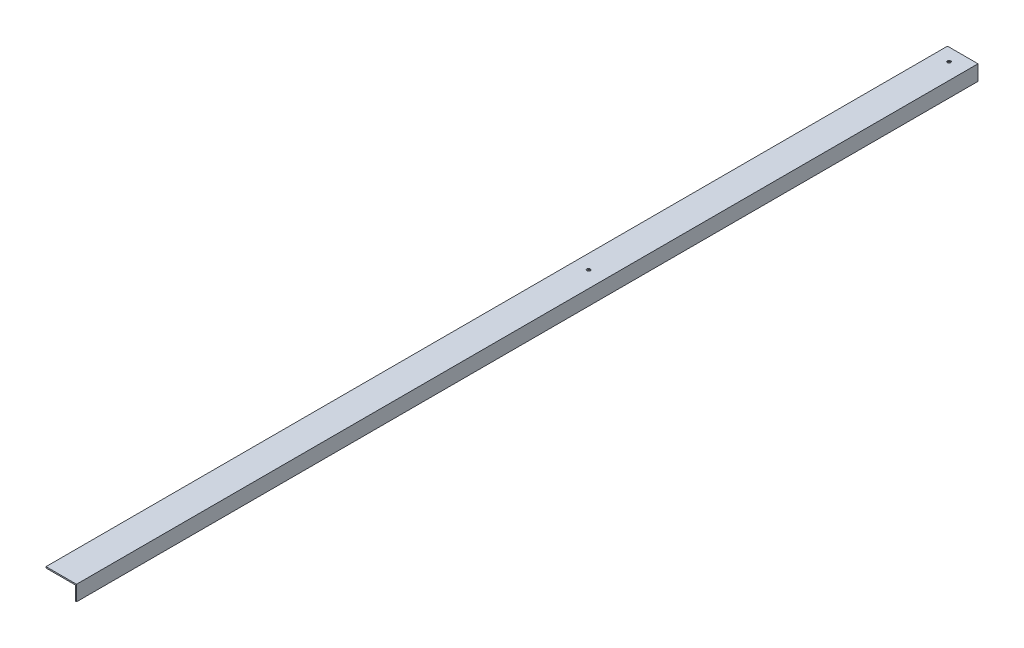
ISO-10303-21;
HEADER;
FILE_DESCRIPTION(('STEP AP214'),'2;1');
FILE_NAME('part.step','',(''),(''),'','','');
FILE_SCHEMA(('AUTOMOTIVE_DESIGN { 1 0 10303 214 1 1 1 1 }'));
ENDSEC;
DATA;
#1=APPLICATION_CONTEXT('core data for automotive mechanical design processes');
#2=APPLICATION_PROTOCOL_DEFINITION('international standard','automotive_design',2000,#1);
#3=PRODUCT_CONTEXT('',#1,'mechanical');
#4=PRODUCT('Part','Part','',(#3));
#5=PRODUCT_RELATED_PRODUCT_CATEGORY('part','',(#4));
#6=PRODUCT_DEFINITION_FORMATION('','',#4);
#7=PRODUCT_DEFINITION_CONTEXT('part definition',#1,'design');
#8=PRODUCT_DEFINITION('design','',#6,#7);
#9=PRODUCT_DEFINITION_SHAPE('','',#8);
#10=(LENGTH_UNIT() NAMED_UNIT(*) SI_UNIT(.MILLI.,.METRE.));
#11=(NAMED_UNIT(*) PLANE_ANGLE_UNIT() SI_UNIT($,.RADIAN.));
#12=(NAMED_UNIT(*) SI_UNIT($,.STERADIAN.) SOLID_ANGLE_UNIT());
#13=UNCERTAINTY_MEASURE_WITH_UNIT(LENGTH_MEASURE(1.E-05),#10,'distance_accuracy_value','');
#14=(GEOMETRIC_REPRESENTATION_CONTEXT(3) GLOBAL_UNCERTAINTY_ASSIGNED_CONTEXT((#13)) GLOBAL_UNIT_ASSIGNED_CONTEXT((#10,
#11,#12)) REPRESENTATION_CONTEXT('',''));
#15=CARTESIAN_POINT('',(0.,0.,0.));
#16=DIRECTION('',(0.,0.,1.));
#17=DIRECTION('',(1.,0.,0.));
#18=AXIS2_PLACEMENT_3D('',#15,#16,#17);
#19=CARTESIAN_POINT('',(-1.5748,0.,1125.4359));
#20=DIRECTION('',(1.,0.,0.));
#21=DIRECTION('',(0.,1.,0.));
#22=AXIS2_PLACEMENT_3D('',#19,#20,#21);
#23=PLANE('',#22);
#24=DIRECTION('',(0.,-1.,0.));
#25=VECTOR('',#24,1.);
#26=CARTESIAN_POINT('',(-1.5748,0.,0.));
#27=LINE('',#26,#25);
#28=CARTESIAN_POINT('',(-1.5748,-1.5748,0.));
#29=VERTEX_POINT('',#28);
#30=CARTESIAN_POINT('',(-1.5748,-19.05,0.));
#31=VERTEX_POINT('',#30);
#32=EDGE_CURVE('E113',#29,#31,#27,.T.);
#33=ORIENTED_EDGE('',*,*,#32,.T.);
#34=DIRECTION('',(0.,0.,-1.));
#35=VECTOR('',#34,1.);
#36=CARTESIAN_POINT('',(-1.5748,-19.05,1125.4359));
#37=LINE('',#36,#35);
#38=CARTESIAN_POINT('',(-1.5748,-19.05,1125.4359));
#39=VERTEX_POINT('',#38);
#40=EDGE_CURVE('E11',#39,#31,#37,.T.);
#41=ORIENTED_EDGE('',*,*,#40,.F.);
#42=DIRECTION('',(0.,-1.,0.));
#43=VECTOR('',#42,1.);
#44=CARTESIAN_POINT('',(-1.5748,0.,1125.4359));
#45=LINE('',#44,#43);
#46=CARTESIAN_POINT('',(-1.5748,-1.5748,1125.4359));
#47=VERTEX_POINT('',#46);
#48=EDGE_CURVE('E78',#47,#39,#45,.T.);
#49=ORIENTED_EDGE('',*,*,#48,.F.);
#50=DIRECTION('',(0.,0.,-1.));
#51=VECTOR('',#50,1.);
#52=CARTESIAN_POINT('',(-1.5748,-1.5748,1125.4359));
#53=LINE('',#52,#51);
#54=EDGE_CURVE('E109',#47,#29,#53,.T.);
#55=ORIENTED_EDGE('',*,*,#54,.T.);
#56=EDGE_LOOP('',(#33,#41,#49,#55));
#57=FACE_BOUND('',#56,.T.);
#58=ADVANCED_FACE('F32',(#57),#23,.F.);
#59=CARTESIAN_POINT('',(0.,-19.05,1125.4359));
#60=DIRECTION('',(0.,-1.,0.));
#61=DIRECTION('',(0.,0.,-1.));
#62=AXIS2_PLACEMENT_3D('',#59,#60,#61);
#63=PLANE('',#62);
#64=DIRECTION('',(-1.,0.,0.));
#65=VECTOR('',#64,1.);
#66=CARTESIAN_POINT('',(0.,-19.05,0.));
#67=LINE('',#66,#65);
#68=CARTESIAN_POINT('',(0.,-19.05,0.));
#69=VERTEX_POINT('',#68);
#70=EDGE_CURVE('E116',#69,#31,#67,.T.);
#71=ORIENTED_EDGE('',*,*,#70,.F.);
#72=DIRECTION('',(0.,0.,-1.));
#73=VECTOR('',#72,1.);
#74=CARTESIAN_POINT('',(0.,-19.05,1125.4359));
#75=LINE('',#74,#73);
#76=CARTESIAN_POINT('',(0.,-19.05,1125.4359));
#77=VERTEX_POINT('',#76);
#78=EDGE_CURVE('E40',#77,#69,#75,.T.);
#79=ORIENTED_EDGE('',*,*,#78,.F.);
#80=DIRECTION('',(-1.,0.,0.));
#81=VECTOR('',#80,1.);
#82=CARTESIAN_POINT('',(0.,-19.05,1125.4359));
#83=LINE('',#82,#81);
#84=EDGE_CURVE('E187',#77,#39,#83,.T.);
#85=ORIENTED_EDGE('',*,*,#84,.T.);
#86=ORIENTED_EDGE('',*,*,#40,.T.);
#87=EDGE_LOOP('',(#71,#79,#85,#86));
#88=FACE_BOUND('',#87,.T.);
#89=ADVANCED_FACE('F135',(#88),#63,.T.);
#90=CARTESIAN_POINT('',(0.,0.,1125.4359));
#91=DIRECTION('',(1.,0.,0.));
#92=DIRECTION('',(0.,1.,0.));
#93=AXIS2_PLACEMENT_3D('',#90,#91,#92);
#94=PLANE('',#93);
#95=DIRECTION('',(0.,-1.,0.));
#96=VECTOR('',#95,1.);
#97=CARTESIAN_POINT('',(0.,0.,0.));
#98=LINE('',#97,#96);
#99=CARTESIAN_POINT('',(0.,0.,0.));
#100=VERTEX_POINT('',#99);
#101=EDGE_CURVE('E120',#100,#69,#98,.T.);
#102=ORIENTED_EDGE('',*,*,#101,.F.);
#103=DIRECTION('',(0.,0.,-1.));
#104=VECTOR('',#103,1.);
#105=CARTESIAN_POINT('',(0.,0.,1125.4359));
#106=LINE('',#105,#104);
#107=CARTESIAN_POINT('',(0.,0.,1125.4359));
#108=VERTEX_POINT('',#107);
#109=EDGE_CURVE('E99',#108,#100,#106,.T.);
#110=ORIENTED_EDGE('',*,*,#109,.F.);
#111=DIRECTION('',(0.,-1.,0.));
#112=VECTOR('',#111,1.);
#113=CARTESIAN_POINT('',(0.,0.,1125.4359));
#114=LINE('',#113,#112);
#115=EDGE_CURVE('E105',#108,#77,#114,.T.);
#116=ORIENTED_EDGE('',*,*,#115,.T.);
#117=ORIENTED_EDGE('',*,*,#78,.T.);
#118=EDGE_LOOP('',(#102,#110,#116,#117));
#119=FACE_BOUND('',#118,.T.);
#120=ADVANCED_FACE('F132',(#119),#94,.T.);
#121=CARTESIAN_POINT('',(-38.1,0.,1125.4359));
#122=DIRECTION('',(0.,1.,0.));
#123=DIRECTION('',(0.,0.,1.));
#124=AXIS2_PLACEMENT_3D('',#121,#122,#123);
#125=PLANE('',#124);
#126=CARTESIAN_POINT('',(-20.32,0.,15.875));
#127=DIRECTION('',(0.,1.,0.));
#128=DIRECTION('',(0.,0.,1.));
#129=AXIS2_PLACEMENT_3D('',#126,#127,#128);
#130=CIRCLE('',#129,2.1082);
#131=CARTESIAN_POINT('',(-20.32,0.,17.9832));
#132=VERTEX_POINT('',#131);
#133=EDGE_CURVE('E169',#132,#132,#130,.T.);
#134=ORIENTED_EDGE('',*,*,#133,.F.);
#135=EDGE_LOOP('',(#134));
#136=FACE_BOUND('',#135,.T.);
#137=CARTESIAN_POINT('',(-20.32,0.,465.875));
#138=DIRECTION('',(0.,1.,0.));
#139=DIRECTION('',(0.,0.,1.));
#140=AXIS2_PLACEMENT_3D('',#137,#138,#139);
#141=CIRCLE('',#140,2.1082);
#142=CARTESIAN_POINT('',(-20.32,0.,467.9832));
#143=VERTEX_POINT('',#142);
#144=EDGE_CURVE('E172',#143,#143,#141,.T.);
#145=ORIENTED_EDGE('',*,*,#144,.F.);
#146=EDGE_LOOP('',(#145));
#147=FACE_BOUND('',#146,.T.);
#148=DIRECTION('',(1.,0.,0.));
#149=VECTOR('',#148,1.);
#150=CARTESIAN_POINT('',(-38.1,0.,0.));
#151=LINE('',#150,#149);
#152=CARTESIAN_POINT('',(-38.1,0.,0.));
#153=VERTEX_POINT('',#152);
#154=EDGE_CURVE('E94',#153,#100,#151,.T.);
#155=ORIENTED_EDGE('',*,*,#154,.F.);
#156=DIRECTION('',(0.,0.,-1.));
#157=VECTOR('',#156,1.);
#158=CARTESIAN_POINT('',(-38.1,0.,1125.4359));
#159=LINE('',#158,#157);
#160=CARTESIAN_POINT('',(-38.1,0.,1125.4359));
#161=VERTEX_POINT('',#160);
#162=EDGE_CURVE('E89',#161,#153,#159,.T.);
#163=ORIENTED_EDGE('',*,*,#162,.F.);
#164=DIRECTION('',(1.,0.,0.));
#165=VECTOR('',#164,1.);
#166=CARTESIAN_POINT('',(-38.1,0.,1125.4359));
#167=LINE('',#166,#165);
#168=EDGE_CURVE('E92',#161,#108,#167,.T.);
#169=ORIENTED_EDGE('',*,*,#168,.T.);
#170=ORIENTED_EDGE('',*,*,#109,.T.);
#171=EDGE_LOOP('',(#155,#163,#169,#170));
#172=FACE_BOUND('',#171,.T.);
#173=ADVANCED_FACE('F91',(#136,#147,#172),#125,.T.);
#174=CARTESIAN_POINT('',(-38.1,-1.5748,1125.4359));
#175=DIRECTION('',(-1.,0.,0.));
#176=DIRECTION('',(0.,0.,1.));
#177=AXIS2_PLACEMENT_3D('',#174,#175,#176);
#178=PLANE('',#177);
#179=DIRECTION('',(0.,1.,0.));
#180=VECTOR('',#179,1.);
#181=CARTESIAN_POINT('',(-38.1,-1.5748,0.));
#182=LINE('',#181,#180);
#183=CARTESIAN_POINT('',(-38.1,-1.5748,0.));
#184=VERTEX_POINT('',#183);
#185=EDGE_CURVE('E124',#184,#153,#182,.T.);
#186=ORIENTED_EDGE('',*,*,#185,.F.);
#187=DIRECTION('',(0.,0.,-1.));
#188=VECTOR('',#187,1.);
#189=CARTESIAN_POINT('',(-38.1,-1.5748,1125.4359));
#190=LINE('',#189,#188);
#191=CARTESIAN_POINT('',(-38.1,-1.5748,1125.4359));
#192=VERTEX_POINT('',#191);
#193=EDGE_CURVE('E69',#192,#184,#190,.T.);
#194=ORIENTED_EDGE('',*,*,#193,.F.);
#195=DIRECTION('',(0.,1.,0.));
#196=VECTOR('',#195,1.);
#197=CARTESIAN_POINT('',(-38.1,-1.5748,1125.4359));
#198=LINE('',#197,#196);
#199=EDGE_CURVE('E103',#192,#161,#198,.T.);
#200=ORIENTED_EDGE('',*,*,#199,.T.);
#201=ORIENTED_EDGE('',*,*,#162,.T.);
#202=EDGE_LOOP('',(#186,#194,#200,#201));
#203=FACE_BOUND('',#202,.T.);
#204=ADVANCED_FACE('F107',(#203),#178,.T.);
#205=CARTESIAN_POINT('',(-38.1,-1.5748,1125.4359));
#206=DIRECTION('',(0.,1.,0.));
#207=DIRECTION('',(0.,0.,1.));
#208=AXIS2_PLACEMENT_3D('',#205,#206,#207);
#209=PLANE('',#208);
#210=CARTESIAN_POINT('',(-20.32,-1.5748,15.875));
#211=DIRECTION('',(0.,1.,0.));
#212=DIRECTION('',(0.,0.,1.));
#213=AXIS2_PLACEMENT_3D('',#210,#211,#212);
#214=CIRCLE('',#213,2.1082);
#215=CARTESIAN_POINT('',(-20.32,-1.5748,17.9832));
#216=VERTEX_POINT('',#215);
#217=EDGE_CURVE('E261',#216,#216,#214,.T.);
#218=ORIENTED_EDGE('',*,*,#217,.T.);
#219=EDGE_LOOP('',(#218));
#220=FACE_BOUND('',#219,.T.);
#221=CARTESIAN_POINT('',(-20.32,-1.5748,465.875));
#222=DIRECTION('',(0.,1.,0.));
#223=DIRECTION('',(0.,0.,1.));
#224=AXIS2_PLACEMENT_3D('',#221,#222,#223);
#225=CIRCLE('',#224,2.1082);
#226=CARTESIAN_POINT('',(-20.32,-1.5748,467.9832));
#227=VERTEX_POINT('',#226);
#228=EDGE_CURVE('E175',#227,#227,#225,.T.);
#229=ORIENTED_EDGE('',*,*,#228,.T.);
#230=EDGE_LOOP('',(#229));
#231=FACE_BOUND('',#230,.T.);
#232=DIRECTION('',(1.,0.,0.));
#233=VECTOR('',#232,1.);
#234=CARTESIAN_POINT('',(-38.1,-1.5748,0.));
#235=LINE('',#234,#233);
#236=EDGE_CURVE('E72',#184,#29,#235,.T.);
#237=ORIENTED_EDGE('',*,*,#236,.T.);
#238=ORIENTED_EDGE('',*,*,#54,.F.);
#239=DIRECTION('',(1.,0.,0.));
#240=VECTOR('',#239,1.);
#241=CARTESIAN_POINT('',(-38.1,-1.5748,1125.4359));
#242=LINE('',#241,#240);
#243=EDGE_CURVE('E48',#192,#47,#242,.T.);
#244=ORIENTED_EDGE('',*,*,#243,.F.);
#245=ORIENTED_EDGE('',*,*,#193,.T.);
#246=EDGE_LOOP('',(#237,#238,#244,#245));
#247=FACE_BOUND('',#246,.T.);
#248=ADVANCED_FACE('F140',(#220,#231,#247),#209,.F.);
#249=CARTESIAN_POINT('',(-1.5748,-19.05,1125.4359));
#250=DIRECTION('',(0.,0.,-1.));
#251=DIRECTION('',(-1.,0.,0.));
#252=AXIS2_PLACEMENT_3D('',#249,#250,#251);
#253=PLANE('',#252);
#254=ORIENTED_EDGE('',*,*,#48,.T.);
#255=ORIENTED_EDGE('',*,*,#84,.F.);
#256=ORIENTED_EDGE('',*,*,#115,.F.);
#257=ORIENTED_EDGE('',*,*,#168,.F.);
#258=ORIENTED_EDGE('',*,*,#199,.F.);
#259=ORIENTED_EDGE('',*,*,#243,.T.);
#260=EDGE_LOOP('',(#254,#255,#256,#257,#258,#259));
#261=FACE_BOUND('',#260,.T.);
#262=ADVANCED_FACE('F102',(#261),#253,.F.);
#263=CARTESIAN_POINT('',(-1.5748,-19.05,0.));
#264=DIRECTION('',(0.,0.,-1.));
#265=DIRECTION('',(-1.,0.,0.));
#266=AXIS2_PLACEMENT_3D('',#263,#264,#265);
#267=PLANE('',#266);
#268=ORIENTED_EDGE('',*,*,#32,.F.);
#269=ORIENTED_EDGE('',*,*,#236,.F.);
#270=ORIENTED_EDGE('',*,*,#185,.T.);
#271=ORIENTED_EDGE('',*,*,#154,.T.);
#272=ORIENTED_EDGE('',*,*,#101,.T.);
#273=ORIENTED_EDGE('',*,*,#70,.T.);
#274=EDGE_LOOP('',(#268,#269,#270,#271,#272,#273));
#275=FACE_BOUND('',#274,.T.);
#276=ADVANCED_FACE('F138',(#275),#267,.T.);
#277=CARTESIAN_POINT('',(-20.32,-0.939799999999998,465.875));
#278=DIRECTION('',(0.,-1.,0.));
#279=DIRECTION('',(0.,0.,-1.));
#280=AXIS2_PLACEMENT_3D('',#277,#278,#279);
#281=CONICAL_SURFACE('',#280,1.4732,0.785398163397447);
#282=ORIENTED_EDGE('',*,*,#228,.F.);
#283=EDGE_LOOP('',(#282));
#284=FACE_BOUND('',#283,.T.);
#285=CARTESIAN_POINT('',(-20.32,-0.939799999999998,465.875));
#286=DIRECTION('',(0.,1.,0.));
#287=DIRECTION('',(0.,0.,1.));
#288=AXIS2_PLACEMENT_3D('',#285,#286,#287);
#289=CIRCLE('',#288,1.4732);
#290=CARTESIAN_POINT('',(-20.32,-0.939799999999998,467.3482));
#291=VERTEX_POINT('',#290);
#292=EDGE_CURVE('E117',#291,#291,#289,.T.);
#293=ORIENTED_EDGE('',*,*,#292,.T.);
#294=EDGE_LOOP('',(#293));
#295=FACE_BOUND('',#294,.T.);
#296=ADVANCED_FACE('F190',(#284,#295),#281,.F.);
#297=CARTESIAN_POINT('',(-20.32,0.,465.875));
#298=DIRECTION('',(0.,1.,0.));
#299=DIRECTION('',(0.,0.,1.));
#300=AXIS2_PLACEMENT_3D('',#297,#298,#299);
#301=CYLINDRICAL_SURFACE('',#300,1.4732);
#302=ORIENTED_EDGE('',*,*,#292,.F.);
#303=EDGE_LOOP('',(#302));
#304=FACE_BOUND('',#303,.T.);
#305=CARTESIAN_POINT('',(-20.32,-0.634999999999998,465.875));
#306=DIRECTION('',(0.,1.,0.));
#307=DIRECTION('',(0.,0.,1.));
#308=AXIS2_PLACEMENT_3D('',#305,#306,#307);
#309=CIRCLE('',#308,1.4732);
#310=CARTESIAN_POINT('',(-20.32,-0.634999999999998,467.3482));
#311=VERTEX_POINT('',#310);
#312=EDGE_CURVE('E174',#311,#311,#309,.T.);
#313=ORIENTED_EDGE('',*,*,#312,.T.);
#314=EDGE_LOOP('',(#313));
#315=FACE_BOUND('',#314,.T.);
#316=ADVANCED_FACE('F192',(#304,#315),#301,.F.);
#317=CARTESIAN_POINT('',(-20.32,0.,465.875));
#318=DIRECTION('',(0.,1.,0.));
#319=DIRECTION('',(0.,0.,1.));
#320=AXIS2_PLACEMENT_3D('',#317,#318,#319);
#321=CONICAL_SURFACE('',#320,2.1082,0.785398163397448);
#322=ORIENTED_EDGE('',*,*,#312,.F.);
#323=EDGE_LOOP('',(#322));
#324=FACE_BOUND('',#323,.T.);
#325=ORIENTED_EDGE('',*,*,#144,.T.);
#326=EDGE_LOOP('',(#325));
#327=FACE_BOUND('',#326,.T.);
#328=ADVANCED_FACE('F195',(#324,#327),#321,.F.);
#329=CARTESIAN_POINT('',(-20.32,-0.939799999999998,15.875));
#330=DIRECTION('',(0.,-1.,0.));
#331=DIRECTION('',(0.,0.,-1.));
#332=AXIS2_PLACEMENT_3D('',#329,#330,#331);
#333=CONICAL_SURFACE('',#332,1.4732,0.785398163397447);
#334=ORIENTED_EDGE('',*,*,#217,.F.);
#335=EDGE_LOOP('',(#334));
#336=FACE_BOUND('',#335,.T.);
#337=CARTESIAN_POINT('',(-20.32,-0.939799999999998,15.875));
#338=DIRECTION('',(0.,1.,0.));
#339=DIRECTION('',(0.,0.,1.));
#340=AXIS2_PLACEMENT_3D('',#337,#338,#339);
#341=CIRCLE('',#340,1.4732);
#342=CARTESIAN_POINT('',(-20.32,-0.939799999999998,17.3482));
#343=VERTEX_POINT('',#342);
#344=EDGE_CURVE('E180',#343,#343,#341,.T.);
#345=ORIENTED_EDGE('',*,*,#344,.T.);
#346=EDGE_LOOP('',(#345));
#347=FACE_BOUND('',#346,.T.);
#348=ADVANCED_FACE('F200',(#336,#347),#333,.F.);
#349=CARTESIAN_POINT('',(-20.32,0.,15.875));
#350=DIRECTION('',(0.,1.,0.));
#351=DIRECTION('',(0.,0.,1.));
#352=AXIS2_PLACEMENT_3D('',#349,#350,#351);
#353=CYLINDRICAL_SURFACE('',#352,1.4732);
#354=ORIENTED_EDGE('',*,*,#344,.F.);
#355=EDGE_LOOP('',(#354));
#356=FACE_BOUND('',#355,.T.);
#357=CARTESIAN_POINT('',(-20.32,-0.634999999999998,15.875));
#358=DIRECTION('',(0.,1.,0.));
#359=DIRECTION('',(0.,0.,1.));
#360=AXIS2_PLACEMENT_3D('',#357,#358,#359);
#361=CIRCLE('',#360,1.4732);
#362=CARTESIAN_POINT('',(-20.32,-0.634999999999998,17.3482));
#363=VERTEX_POINT('',#362);
#364=EDGE_CURVE('E260',#363,#363,#361,.T.);
#365=ORIENTED_EDGE('',*,*,#364,.T.);
#366=EDGE_LOOP('',(#365));
#367=FACE_BOUND('',#366,.T.);
#368=ADVANCED_FACE('F205',(#356,#367),#353,.F.);
#369=CARTESIAN_POINT('',(-20.32,0.,15.875));
#370=DIRECTION('',(0.,1.,0.));
#371=DIRECTION('',(0.,0.,1.));
#372=AXIS2_PLACEMENT_3D('',#369,#370,#371);
#373=CONICAL_SURFACE('',#372,2.1082,0.785398163397448);
#374=ORIENTED_EDGE('',*,*,#364,.F.);
#375=EDGE_LOOP('',(#374));
#376=FACE_BOUND('',#375,.T.);
#377=ORIENTED_EDGE('',*,*,#133,.T.);
#378=EDGE_LOOP('',(#377));
#379=FACE_BOUND('',#378,.T.);
#380=ADVANCED_FACE('F244',(#376,#379),#373,.F.);
#381=CLOSED_SHELL('',(#58,#89,#120,#173,#204,#248,#262,#276,#296,#316,#328,#348,#368,#380));
#382=MANIFOLD_SOLID_BREP('B2',#381);
#383=ADVANCED_BREP_SHAPE_REPRESENTATION('',(#18,#382),#14);
#384=SHAPE_DEFINITION_REPRESENTATION(#9,#383);
ENDSEC;
END-ISO-10303-21;
